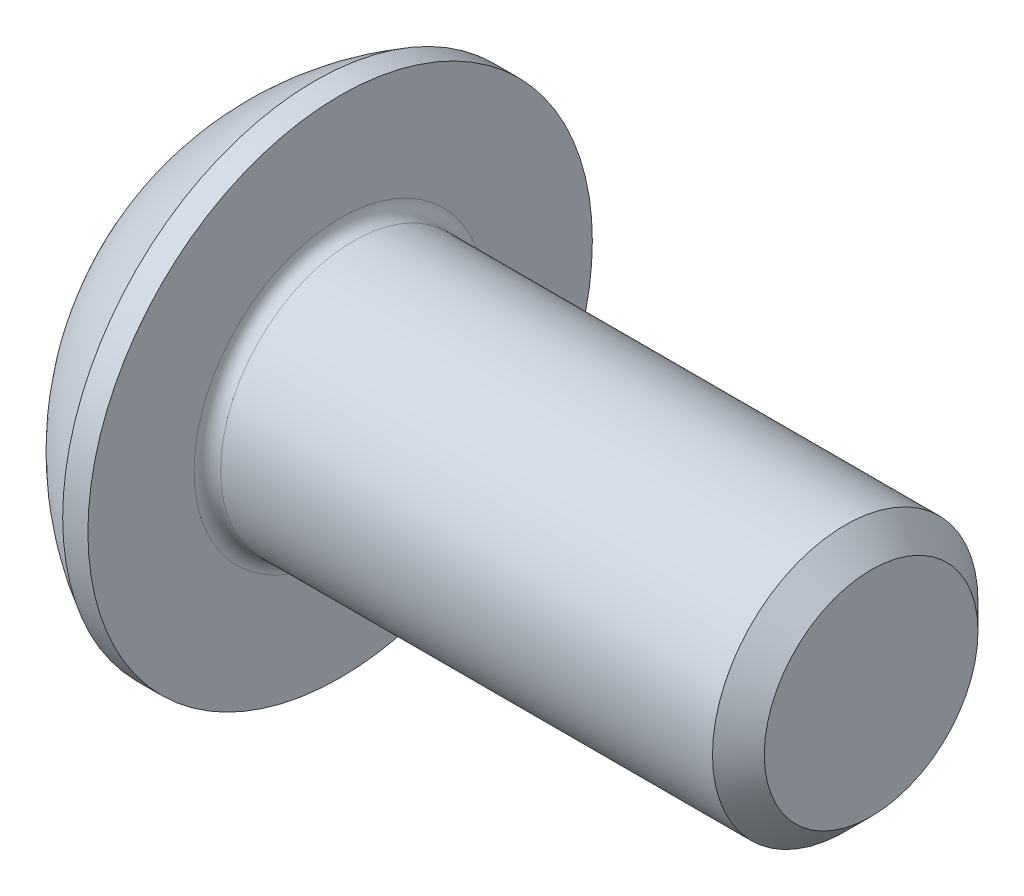
ISO-10303-21;
HEADER;
FILE_DESCRIPTION(('STEP AP214'),'2;1');
FILE_NAME('part.step','',(''),(''),'','','');
FILE_SCHEMA(('AUTOMOTIVE_DESIGN { 1 0 10303 214 1 1 1 1 }'));
ENDSEC;
DATA;
#1=APPLICATION_CONTEXT('core data for automotive mechanical design processes');
#2=APPLICATION_PROTOCOL_DEFINITION('international standard','automotive_design',2000,#1);
#3=PRODUCT_CONTEXT('',#1,'mechanical');
#4=PRODUCT('Part','Part','',(#3));
#5=PRODUCT_RELATED_PRODUCT_CATEGORY('part','',(#4));
#6=PRODUCT_DEFINITION_FORMATION('','',#4);
#7=PRODUCT_DEFINITION_CONTEXT('part definition',#1,'design');
#8=PRODUCT_DEFINITION('design','',#6,#7);
#9=PRODUCT_DEFINITION_SHAPE('','',#8);
#10=(LENGTH_UNIT() NAMED_UNIT(*) SI_UNIT(.MILLI.,.METRE.));
#11=(NAMED_UNIT(*) PLANE_ANGLE_UNIT() SI_UNIT($,.RADIAN.));
#12=(NAMED_UNIT(*) SI_UNIT($,.STERADIAN.) SOLID_ANGLE_UNIT());
#13=UNCERTAINTY_MEASURE_WITH_UNIT(LENGTH_MEASURE(1.E-05),#10,'distance_accuracy_value','');
#14=(GEOMETRIC_REPRESENTATION_CONTEXT(3) GLOBAL_UNCERTAINTY_ASSIGNED_CONTEXT((#13)) GLOBAL_UNIT_ASSIGNED_CONTEXT((#10,
#11,#12)) REPRESENTATION_CONTEXT('',''));
#15=CARTESIAN_POINT('',(0.,0.,0.));
#16=DIRECTION('',(0.,0.,1.));
#17=DIRECTION('',(1.,0.,0.));
#18=AXIS2_PLACEMENT_3D('',#15,#16,#17);
#19=CARTESIAN_POINT('',(0.,0.,0.));
#20=DIRECTION('',(-1.,0.,0.));
#21=DIRECTION('',(0.,0.,1.));
#22=AXIS2_PLACEMENT_3D('',#19,#20,#21);
#23=PLANE('',#22);
#24=CARTESIAN_POINT('',(0.,0.,0.));
#25=DIRECTION('',(-1.,0.,0.));
#26=DIRECTION('',(0.,0.,1.));
#27=AXIS2_PLACEMENT_3D('',#24,#25,#26);
#28=CIRCLE('',#27,1.9);
#29=CARTESIAN_POINT('',(0.,0.,1.9));
#30=VERTEX_POINT('',#29);
#31=EDGE_CURVE('E158',#30,#30,#28,.T.);
#32=ORIENTED_EDGE('',*,*,#31,.T.);
#33=EDGE_LOOP('',(#32));
#34=FACE_BOUND('',#33,.T.);
#35=DIRECTION('',(0.,-1.,0.));
#36=VECTOR('',#35,1.);
#37=CARTESIAN_POINT('',(0.,-0.721687836487031,1.25));
#38=LINE('',#37,#36);
#39=CARTESIAN_POINT('',(0.,0.721687836487033,1.25));
#40=VERTEX_POINT('',#39);
#41=CARTESIAN_POINT('',(0.,-0.721687836487031,1.25));
#42=VERTEX_POINT('',#41);
#43=EDGE_CURVE('E53',#40,#42,#38,.T.);
#44=ORIENTED_EDGE('',*,*,#43,.T.);
#45=DIRECTION('',(0.,-0.5,-0.866025403784438));
#46=VECTOR('',#45,1.);
#47=CARTESIAN_POINT('',(0.,-1.44337567297406,0.));
#48=LINE('',#47,#46);
#49=CARTESIAN_POINT('',(0.,-1.44337567297406,0.));
#50=VERTEX_POINT('',#49);
#51=EDGE_CURVE('E278',#42,#50,#48,.T.);
#52=ORIENTED_EDGE('',*,*,#51,.T.);
#53=DIRECTION('',(0.,0.5,-0.866025403784438));
#54=VECTOR('',#53,1.);
#55=CARTESIAN_POINT('',(0.,-0.721687836487032,-1.25));
#56=LINE('',#55,#54);
#57=CARTESIAN_POINT('',(0.,-0.721687836487032,-1.25));
#58=VERTEX_POINT('',#57);
#59=EDGE_CURVE('E133',#50,#58,#56,.T.);
#60=ORIENTED_EDGE('',*,*,#59,.T.);
#61=DIRECTION('',(0.,1.,0.));
#62=VECTOR('',#61,1.);
#63=CARTESIAN_POINT('',(0.,0.721687836487033,-1.25));
#64=LINE('',#63,#62);
#65=CARTESIAN_POINT('',(0.,0.721687836487033,-1.25));
#66=VERTEX_POINT('',#65);
#67=EDGE_CURVE('E281',#58,#66,#64,.T.);
#68=ORIENTED_EDGE('',*,*,#67,.T.);
#69=DIRECTION('',(0.,0.5,0.866025403784439));
#70=VECTOR('',#69,1.);
#71=CARTESIAN_POINT('',(0.,1.44337567297406,0.));
#72=LINE('',#71,#70);
#73=CARTESIAN_POINT('',(0.,1.44337567297406,0.));
#74=VERTEX_POINT('',#73);
#75=EDGE_CURVE('E283',#66,#74,#72,.T.);
#76=ORIENTED_EDGE('',*,*,#75,.T.);
#77=DIRECTION('',(0.,-0.5,0.866025403784439));
#78=VECTOR('',#77,1.);
#79=CARTESIAN_POINT('',(0.,0.721687836487033,1.25));
#80=LINE('',#79,#78);
#81=EDGE_CURVE('E285',#74,#40,#80,.T.);
#82=ORIENTED_EDGE('',*,*,#81,.T.);
#83=EDGE_LOOP('',(#44,#52,#60,#68,#76,#82));
#84=FACE_BOUND('',#83,.T.);
#85=ADVANCED_FACE('F38',(#34,#84),#23,.T.);
#86=CARTESIAN_POINT('',(3.88527472527473,0.,0.));
#87=DIRECTION('',(-1.,0.,0.));
#88=DIRECTION('',(0.,1.,0.));
#89=AXIS2_PLACEMENT_3D('',#86,#87,#88);
#90=SPHERICAL_SURFACE('',#89,4.3249693283142);
#91=CARTESIAN_POINT('',(1.82,0.,0.));
#92=DIRECTION('',(-1.,0.,0.));
#93=DIRECTION('',(0.,0.,1.));
#94=AXIS2_PLACEMENT_3D('',#91,#92,#93);
#95=CIRCLE('',#94,3.8);
#96=CARTESIAN_POINT('',(1.82,0.,3.8));
#97=VERTEX_POINT('',#96);
#98=EDGE_CURVE('E155',#97,#97,#95,.T.);
#99=ORIENTED_EDGE('',*,*,#98,.T.);
#100=EDGE_LOOP('',(#99));
#101=FACE_BOUND('',#100,.T.);
#102=ORIENTED_EDGE('',*,*,#31,.F.);
#103=EDGE_LOOP('',(#102));
#104=FACE_BOUND('',#103,.T.);
#105=ADVANCED_FACE('F179',(#101,#104),#90,.T.);
#106=CARTESIAN_POINT('',(0.,0.,0.));
#107=DIRECTION('',(-1.,0.,0.));
#108=DIRECTION('',(0.,0.,1.));
#109=AXIS2_PLACEMENT_3D('',#106,#107,#108);
#110=CYLINDRICAL_SURFACE('',#109,3.8);
#111=ORIENTED_EDGE('',*,*,#98,.F.);
#112=EDGE_LOOP('',(#111));
#113=FACE_BOUND('',#112,.T.);
#114=CARTESIAN_POINT('',(2.2,0.,0.));
#115=DIRECTION('',(-1.,0.,0.));
#116=DIRECTION('',(0.,0.,1.));
#117=AXIS2_PLACEMENT_3D('',#114,#115,#116);
#118=CIRCLE('',#117,3.8);
#119=CARTESIAN_POINT('',(2.2,0.,3.8));
#120=VERTEX_POINT('',#119);
#121=EDGE_CURVE('E152',#120,#120,#118,.T.);
#122=ORIENTED_EDGE('',*,*,#121,.T.);
#123=EDGE_LOOP('',(#122));
#124=FACE_BOUND('',#123,.T.);
#125=ADVANCED_FACE('F184',(#113,#124),#110,.T.);
#126=CARTESIAN_POINT('',(2.2,2.,0.));
#127=DIRECTION('',(-1.,0.,0.));
#128=DIRECTION('',(0.,0.,1.));
#129=AXIS2_PLACEMENT_3D('',#126,#127,#128);
#130=PLANE('',#129);
#131=CARTESIAN_POINT('',(2.2,0.,0.));
#132=DIRECTION('',(-1.,0.,0.));
#133=DIRECTION('',(0.,0.,1.));
#134=AXIS2_PLACEMENT_3D('',#131,#132,#133);
#135=CIRCLE('',#134,2.2);
#136=CARTESIAN_POINT('',(2.2,0.,2.2));
#137=VERTEX_POINT('',#136);
#138=EDGE_CURVE('E46',#137,#137,#135,.T.);
#139=ORIENTED_EDGE('',*,*,#138,.T.);
#140=EDGE_LOOP('',(#139));
#141=FACE_BOUND('',#140,.T.);
#142=ORIENTED_EDGE('',*,*,#121,.F.);
#143=EDGE_LOOP('',(#142));
#144=FACE_BOUND('',#143,.T.);
#145=ADVANCED_FACE('F163',(#141,#144),#130,.F.);
#146=CARTESIAN_POINT('',(0.,0.,0.));
#147=DIRECTION('',(-1.,0.,0.));
#148=DIRECTION('',(0.,0.,1.));
#149=AXIS2_PLACEMENT_3D('',#146,#147,#148);
#150=CYLINDRICAL_SURFACE('',#149,2.);
#151=CARTESIAN_POINT('',(2.4,0.,0.));
#152=DIRECTION('',(-1.,0.,0.));
#153=DIRECTION('',(0.,0.,1.));
#154=AXIS2_PLACEMENT_3D('',#151,#152,#153);
#155=CIRCLE('',#154,2.);
#156=CARTESIAN_POINT('',(2.4,0.,2.));
#157=VERTEX_POINT('',#156);
#158=EDGE_CURVE('E11',#157,#157,#155,.F.);
#159=ORIENTED_EDGE('',*,*,#158,.T.);
#160=EDGE_LOOP('',(#159));
#161=FACE_BOUND('',#160,.T.);
#162=CARTESIAN_POINT('',(9.81,0.,0.));
#163=DIRECTION('',(-1.,0.,0.));
#164=DIRECTION('',(0.,0.,1.));
#165=AXIS2_PLACEMENT_3D('',#162,#163,#164);
#166=CIRCLE('',#165,2.);
#167=CARTESIAN_POINT('',(9.81,0.,2.));
#168=VERTEX_POINT('',#167);
#169=EDGE_CURVE('E149',#168,#168,#166,.T.);
#170=ORIENTED_EDGE('',*,*,#169,.T.);
#171=EDGE_LOOP('',(#170));
#172=FACE_BOUND('',#171,.T.);
#173=ADVANCED_FACE('F193',(#161,#172),#150,.T.);
#174=CARTESIAN_POINT('',(10.2,0.,0.));
#175=DIRECTION('',(-1.,0.,0.));
#176=DIRECTION('',(0.,0.,1.));
#177=AXIS2_PLACEMENT_3D('',#174,#175,#176);
#178=CONICAL_SURFACE('',#177,1.61,0.785398163397442);
#179=ORIENTED_EDGE('',*,*,#169,.F.);
#180=EDGE_LOOP('',(#179));
#181=FACE_BOUND('',#180,.T.);
#182=CARTESIAN_POINT('',(10.2,0.,0.));
#183=DIRECTION('',(-1.,0.,0.));
#184=DIRECTION('',(0.,0.,1.));
#185=AXIS2_PLACEMENT_3D('',#182,#183,#184);
#186=CIRCLE('',#185,1.61);
#187=CARTESIAN_POINT('',(10.2,0.,1.61));
#188=VERTEX_POINT('',#187);
#189=EDGE_CURVE('E145',#188,#188,#186,.T.);
#190=ORIENTED_EDGE('',*,*,#189,.T.);
#191=EDGE_LOOP('',(#190));
#192=FACE_BOUND('',#191,.T.);
#193=ADVANCED_FACE('F174',(#181,#192),#178,.T.);
#194=CARTESIAN_POINT('',(10.2,0.,0.));
#195=DIRECTION('',(-1.,0.,0.));
#196=DIRECTION('',(0.,0.,1.));
#197=AXIS2_PLACEMENT_3D('',#194,#195,#196);
#198=PLANE('',#197);
#199=ORIENTED_EDGE('',*,*,#189,.F.);
#200=EDGE_LOOP('',(#199));
#201=FACE_BOUND('',#200,.T.);
#202=ADVANCED_FACE('F167',(#201),#198,.F.);
#203=CARTESIAN_POINT('',(2.4,0.,0.));
#204=DIRECTION('',(-1.,0.,0.));
#205=DIRECTION('',(0.,0.,1.));
#206=AXIS2_PLACEMENT_3D('',#203,#204,#205);
#207=TOROIDAL_SURFACE('',#206,2.2,0.2);
#208=ORIENTED_EDGE('',*,*,#158,.F.);
#209=EDGE_LOOP('',(#208));
#210=FACE_BOUND('',#209,.T.);
#211=ORIENTED_EDGE('',*,*,#138,.F.);
#212=EDGE_LOOP('',(#211));
#213=FACE_BOUND('',#212,.T.);
#214=ADVANCED_FACE('F40',(#210,#213),#207,.F.);
#215=CARTESIAN_POINT('',(1.3,-1.44337567297406,0.));
#216=DIRECTION('',(0.,0.866025403784438,-0.5));
#217=DIRECTION('',(0.,0.5,0.866025403784438));
#218=AXIS2_PLACEMENT_3D('',#215,#216,#217);
#219=PLANE('',#218);
#220=DIRECTION('',(0.,-0.5,-0.866025403784438));
#221=VECTOR('',#220,1.);
#222=CARTESIAN_POINT('',(1.3,-1.44337567297406,0.));
#223=LINE('',#222,#221);
#224=CARTESIAN_POINT('',(1.3,-0.721687836487031,1.25));
#225=VERTEX_POINT('',#224);
#226=CARTESIAN_POINT('',(1.3,-1.08253175473055,0.625));
#227=VERTEX_POINT('',#226);
#228=EDGE_CURVE('E119',#225,#227,#223,.T.);
#229=ORIENTED_EDGE('',*,*,#228,.T.);
#230=CARTESIAN_POINT('',(1.3,-1.44337567297406,0.));
#231=VERTEX_POINT('',#230);
#232=EDGE_CURVE('E114',#227,#231,#223,.T.);
#233=ORIENTED_EDGE('',*,*,#232,.T.);
#234=DIRECTION('',(-1.,0.,0.));
#235=VECTOR('',#234,1.);
#236=CARTESIAN_POINT('',(1.3,-1.44337567297406,0.));
#237=LINE('',#236,#235);
#238=EDGE_CURVE('E116',#231,#50,#237,.T.);
#239=ORIENTED_EDGE('',*,*,#238,.T.);
#240=ORIENTED_EDGE('',*,*,#51,.F.);
#241=DIRECTION('',(-1.,0.,0.));
#242=VECTOR('',#241,1.);
#243=CARTESIAN_POINT('',(1.3,-0.721687836487031,1.25));
#244=LINE('',#243,#242);
#245=EDGE_CURVE('E274',#225,#42,#244,.T.);
#246=ORIENTED_EDGE('',*,*,#245,.F.);
#247=EDGE_LOOP('',(#229,#233,#239,#240,#246));
#248=FACE_BOUND('',#247,.T.);
#249=ADVANCED_FACE('F115',(#248),#219,.T.);
#250=CARTESIAN_POINT('',(1.3,-0.721687836487032,-1.25));
#251=DIRECTION('',(0.,0.866025403784438,0.5));
#252=DIRECTION('',(0.,-0.5,0.866025403784439));
#253=AXIS2_PLACEMENT_3D('',#250,#251,#252);
#254=PLANE('',#253);
#255=DIRECTION('',(0.,0.5,-0.866025403784438));
#256=VECTOR('',#255,1.);
#257=CARTESIAN_POINT('',(1.3,-0.721687836487032,-1.25));
#258=LINE('',#257,#256);
#259=CARTESIAN_POINT('',(1.3,-1.08253175473055,-0.625000000000001));
#260=VERTEX_POINT('',#259);
#261=EDGE_CURVE('E61',#231,#260,#258,.T.);
#262=ORIENTED_EDGE('',*,*,#261,.T.);
#263=CARTESIAN_POINT('',(1.3,-0.721687836487032,-1.25));
#264=VERTEX_POINT('',#263);
#265=EDGE_CURVE('E128',#260,#264,#258,.T.);
#266=ORIENTED_EDGE('',*,*,#265,.T.);
#267=DIRECTION('',(-1.,0.,0.));
#268=VECTOR('',#267,1.);
#269=CARTESIAN_POINT('',(1.3,-0.721687836487032,-1.25));
#270=LINE('',#269,#268);
#271=EDGE_CURVE('E135',#264,#58,#270,.T.);
#272=ORIENTED_EDGE('',*,*,#271,.T.);
#273=ORIENTED_EDGE('',*,*,#59,.F.);
#274=ORIENTED_EDGE('',*,*,#238,.F.);
#275=EDGE_LOOP('',(#262,#266,#272,#273,#274));
#276=FACE_BOUND('',#275,.T.);
#277=ADVANCED_FACE('F131',(#276),#254,.T.);
#278=CARTESIAN_POINT('',(1.3,0.721687836487033,-1.25));
#279=DIRECTION('',(0.,0.,1.));
#280=DIRECTION('',(1.,0.,0.));
#281=AXIS2_PLACEMENT_3D('',#278,#279,#280);
#282=PLANE('',#281);
#283=DIRECTION('',(0.,1.,0.));
#284=VECTOR('',#283,1.);
#285=CARTESIAN_POINT('',(1.3,0.721687836487033,-1.25));
#286=LINE('',#285,#284);
#287=CARTESIAN_POINT('',(1.3,0.,-1.25));
#288=VERTEX_POINT('',#287);
#289=EDGE_CURVE('E255',#264,#288,#286,.T.);
#290=ORIENTED_EDGE('',*,*,#289,.T.);
#291=CARTESIAN_POINT('',(1.3,0.721687836487033,-1.25));
#292=VERTEX_POINT('',#291);
#293=EDGE_CURVE('E127',#288,#292,#286,.T.);
#294=ORIENTED_EDGE('',*,*,#293,.T.);
#295=DIRECTION('',(-1.,0.,0.));
#296=VECTOR('',#295,1.);
#297=CARTESIAN_POINT('',(1.3,0.721687836487033,-1.25));
#298=LINE('',#297,#296);
#299=EDGE_CURVE('E140',#292,#66,#298,.T.);
#300=ORIENTED_EDGE('',*,*,#299,.T.);
#301=ORIENTED_EDGE('',*,*,#67,.F.);
#302=ORIENTED_EDGE('',*,*,#271,.F.);
#303=EDGE_LOOP('',(#290,#294,#300,#301,#302));
#304=FACE_BOUND('',#303,.T.);
#305=ADVANCED_FACE('F207',(#304),#282,.T.);
#306=CARTESIAN_POINT('',(1.3,1.44337567297406,0.));
#307=DIRECTION('',(0.,-0.866025403784439,0.5));
#308=DIRECTION('',(0.,-0.5,-0.866025403784439));
#309=AXIS2_PLACEMENT_3D('',#306,#307,#308);
#310=PLANE('',#309);
#311=DIRECTION('',(0.,0.5,0.866025403784439));
#312=VECTOR('',#311,1.);
#313=CARTESIAN_POINT('',(1.3,1.44337567297406,0.));
#314=LINE('',#313,#312);
#315=CARTESIAN_POINT('',(1.3,1.08253175473055,-0.625));
#316=VERTEX_POINT('',#315);
#317=EDGE_CURVE('E244',#292,#316,#314,.T.);
#318=ORIENTED_EDGE('',*,*,#317,.T.);
#319=CARTESIAN_POINT('',(1.3,1.44337567297406,0.));
#320=VERTEX_POINT('',#319);
#321=EDGE_CURVE('E249',#316,#320,#314,.T.);
#322=ORIENTED_EDGE('',*,*,#321,.T.);
#323=DIRECTION('',(-1.,0.,0.));
#324=VECTOR('',#323,1.);
#325=CARTESIAN_POINT('',(1.3,1.44337567297406,0.));
#326=LINE('',#325,#324);
#327=EDGE_CURVE('E289',#320,#74,#326,.T.);
#328=ORIENTED_EDGE('',*,*,#327,.T.);
#329=ORIENTED_EDGE('',*,*,#75,.F.);
#330=ORIENTED_EDGE('',*,*,#299,.F.);
#331=EDGE_LOOP('',(#318,#322,#328,#329,#330));
#332=FACE_BOUND('',#331,.T.);
#333=ADVANCED_FACE('F210',(#332),#310,.T.);
#334=CARTESIAN_POINT('',(1.3,0.721687836487033,1.25));
#335=DIRECTION('',(0.,-0.866025403784439,-0.5));
#336=DIRECTION('',(0.,0.5,-0.866025403784439));
#337=AXIS2_PLACEMENT_3D('',#334,#335,#336);
#338=PLANE('',#337);
#339=DIRECTION('',(0.,-0.5,0.866025403784439));
#340=VECTOR('',#339,1.);
#341=CARTESIAN_POINT('',(1.3,0.721687836487033,1.25));
#342=LINE('',#341,#340);
#343=CARTESIAN_POINT('',(1.3,1.08253175473055,0.625));
#344=VERTEX_POINT('',#343);
#345=EDGE_CURVE('E252',#320,#344,#342,.T.);
#346=ORIENTED_EDGE('',*,*,#345,.T.);
#347=CARTESIAN_POINT('',(1.3,0.721687836487033,1.25));
#348=VERTEX_POINT('',#347);
#349=EDGE_CURVE('E260',#344,#348,#342,.T.);
#350=ORIENTED_EDGE('',*,*,#349,.T.);
#351=DIRECTION('',(-1.,0.,0.));
#352=VECTOR('',#351,1.);
#353=CARTESIAN_POINT('',(1.3,0.721687836487033,1.25));
#354=LINE('',#353,#352);
#355=EDGE_CURVE('E273',#348,#40,#354,.T.);
#356=ORIENTED_EDGE('',*,*,#355,.T.);
#357=ORIENTED_EDGE('',*,*,#81,.F.);
#358=ORIENTED_EDGE('',*,*,#327,.F.);
#359=EDGE_LOOP('',(#346,#350,#356,#357,#358));
#360=FACE_BOUND('',#359,.T.);
#361=ADVANCED_FACE('F214',(#360),#338,.T.);
#362=CARTESIAN_POINT('',(1.3,-0.721687836487031,1.25));
#363=DIRECTION('',(0.,0.,-1.));
#364=DIRECTION('',(0.,1.,0.));
#365=AXIS2_PLACEMENT_3D('',#362,#363,#364);
#366=PLANE('',#365);
#367=DIRECTION('',(0.,-1.,0.));
#368=VECTOR('',#367,1.);
#369=CARTESIAN_POINT('',(1.3,-0.721687836487031,1.25));
#370=LINE('',#369,#368);
#371=CARTESIAN_POINT('',(1.3,0.,1.25));
#372=VERTEX_POINT('',#371);
#373=EDGE_CURVE('E266',#348,#372,#370,.T.);
#374=ORIENTED_EDGE('',*,*,#373,.T.);
#375=EDGE_CURVE('E268',#372,#225,#370,.T.);
#376=ORIENTED_EDGE('',*,*,#375,.T.);
#377=ORIENTED_EDGE('',*,*,#245,.T.);
#378=ORIENTED_EDGE('',*,*,#43,.F.);
#379=ORIENTED_EDGE('',*,*,#355,.F.);
#380=EDGE_LOOP('',(#374,#376,#377,#378,#379));
#381=FACE_BOUND('',#380,.T.);
#382=ADVANCED_FACE('F218',(#381),#366,.T.);
#383=CARTESIAN_POINT('',(1.3,-1.44337567297406,0.));
#384=DIRECTION('',(1.,0.,0.));
#385=DIRECTION('',(0.,0.,-1.));
#386=AXIS2_PLACEMENT_3D('',#383,#384,#385);
#387=PLANE('',#386);
#388=CARTESIAN_POINT('',(1.3,0.,0.));
#389=DIRECTION('',(-1.,0.,0.));
#390=DIRECTION('',(0.,0.,1.));
#391=AXIS2_PLACEMENT_3D('',#388,#389,#390);
#392=CIRCLE('',#391,1.25);
#393=EDGE_CURVE('E241',#316,#288,#392,.T.);
#394=ORIENTED_EDGE('',*,*,#393,.F.);
#395=ORIENTED_EDGE('',*,*,#317,.F.);
#396=ORIENTED_EDGE('',*,*,#293,.F.);
#397=EDGE_LOOP('',(#394,#395,#396));
#398=FACE_BOUND('',#397,.T.);
#399=ADVANCED_FACE('F222',(#398),#387,.F.);
#400=EDGE_CURVE('E146',#344,#316,#392,.T.);
#401=ORIENTED_EDGE('',*,*,#400,.F.);
#402=ORIENTED_EDGE('',*,*,#345,.F.);
#403=ORIENTED_EDGE('',*,*,#321,.F.);
#404=EDGE_LOOP('',(#401,#402,#403));
#405=FACE_BOUND('',#404,.T.);
#406=ADVANCED_FACE('F231',(#405),#387,.F.);
#407=EDGE_CURVE('E139',#372,#344,#392,.T.);
#408=ORIENTED_EDGE('',*,*,#407,.F.);
#409=ORIENTED_EDGE('',*,*,#373,.F.);
#410=ORIENTED_EDGE('',*,*,#349,.F.);
#411=EDGE_LOOP('',(#408,#409,#410));
#412=FACE_BOUND('',#411,.T.);
#413=ADVANCED_FACE('F236',(#412),#387,.F.);
#414=EDGE_CURVE('E134',#227,#372,#392,.T.);
#415=ORIENTED_EDGE('',*,*,#414,.F.);
#416=ORIENTED_EDGE('',*,*,#228,.F.);
#417=ORIENTED_EDGE('',*,*,#375,.F.);
#418=EDGE_LOOP('',(#415,#416,#417));
#419=FACE_BOUND('',#418,.T.);
#420=ADVANCED_FACE('F229',(#419),#387,.F.);
#421=EDGE_CURVE('E125',#260,#227,#392,.T.);
#422=ORIENTED_EDGE('',*,*,#421,.F.);
#423=ORIENTED_EDGE('',*,*,#261,.F.);
#424=ORIENTED_EDGE('',*,*,#232,.F.);
#425=EDGE_LOOP('',(#422,#423,#424));
#426=FACE_BOUND('',#425,.T.);
#427=ADVANCED_FACE('F124',(#426),#387,.F.);
#428=EDGE_CURVE('E247',#288,#260,#392,.T.);
#429=ORIENTED_EDGE('',*,*,#428,.F.);
#430=ORIENTED_EDGE('',*,*,#289,.F.);
#431=ORIENTED_EDGE('',*,*,#265,.F.);
#432=EDGE_LOOP('',(#429,#430,#431));
#433=FACE_BOUND('',#432,.T.);
#434=ADVANCED_FACE('F202',(#433),#387,.F.);
#435=CARTESIAN_POINT('',(2.02168783648704,0.,0.));
#436=DIRECTION('',(-1.,0.,0.));
#437=DIRECTION('',(0.,0.,1.));
#438=AXIS2_PLACEMENT_3D('',#435,#436,#437);
#439=CONICAL_SURFACE('',#438,0.,1.04719755119659);
#440=ORIENTED_EDGE('',*,*,#407,.T.);
#441=ORIENTED_EDGE('',*,*,#400,.T.);
#442=ORIENTED_EDGE('',*,*,#393,.T.);
#443=ORIENTED_EDGE('',*,*,#428,.T.);
#444=ORIENTED_EDGE('',*,*,#421,.T.);
#445=ORIENTED_EDGE('',*,*,#414,.T.);
#446=EDGE_LOOP('',(#440,#441,#442,#443,#444,#445));
#447=FACE_BOUND('',#446,.T.);
#448=CARTESIAN_POINT('',(2.02168783648704,0.,0.));
#449=VERTEX_POINT('',#448);
#450=VERTEX_LOOP('',#449);
#451=FACE_BOUND('',#450,.T.);
#452=ADVANCED_FACE('F200',(#447,#451),#439,.F.);
#453=CLOSED_SHELL('',(#85,#105,#125,#145,#173,#193,#202,#214,#249,#277,#305,#333,#361,#382,#399,
#406,#413,#420,#427,#434,#452));
#454=MANIFOLD_SOLID_BREP('B2',#453);
#455=ADVANCED_BREP_SHAPE_REPRESENTATION('',(#18,#454),#14);
#456=SHAPE_DEFINITION_REPRESENTATION(#9,#455);
ENDSEC;
END-ISO-10303-21;
